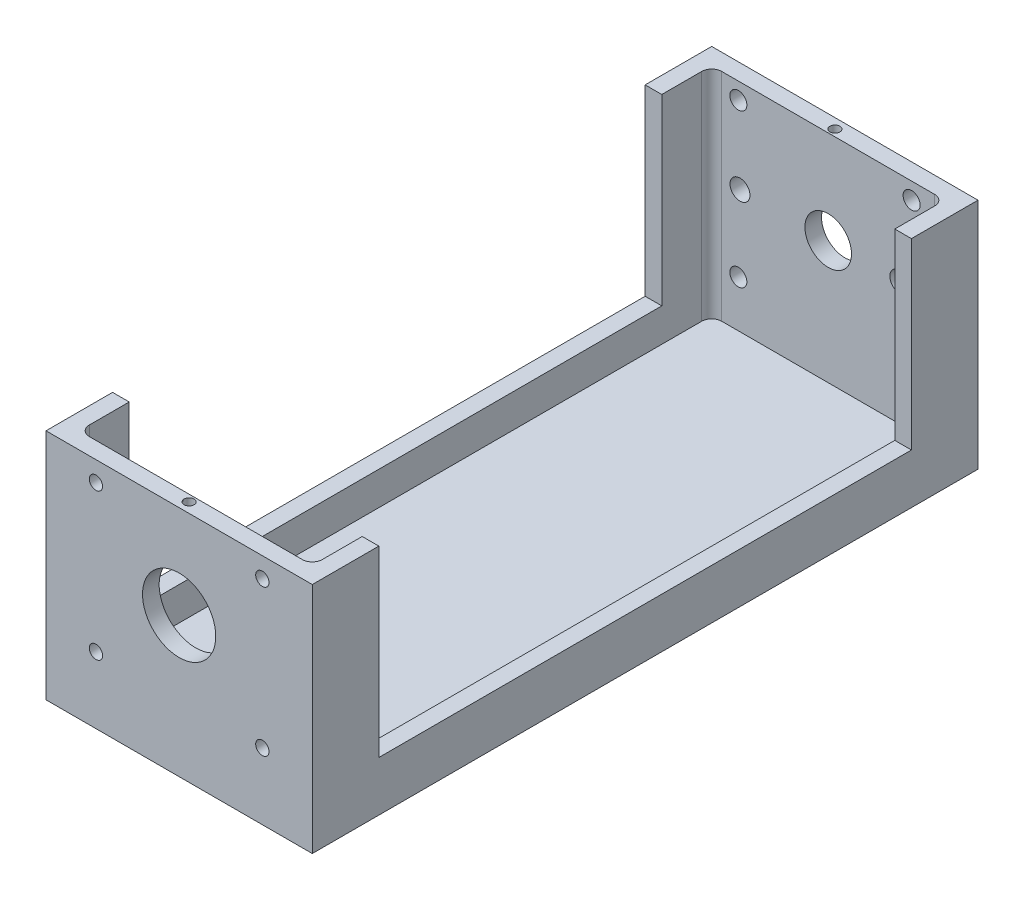
ISO-10303-21;
HEADER;
FILE_DESCRIPTION(('STEP AP214'),'2;1');
FILE_NAME('part.step','',(''),(''),'','','');
FILE_SCHEMA(('AUTOMOTIVE_DESIGN { 1 0 10303 214 1 1 1 1 }'));
ENDSEC;
DATA;
#1=APPLICATION_CONTEXT('core data for automotive mechanical design processes');
#2=APPLICATION_PROTOCOL_DEFINITION('international standard','automotive_design',2000,#1);
#3=PRODUCT_CONTEXT('',#1,'mechanical');
#4=PRODUCT('Part','Part','',(#3));
#5=PRODUCT_RELATED_PRODUCT_CATEGORY('part','',(#4));
#6=PRODUCT_DEFINITION_FORMATION('','',#4);
#7=PRODUCT_DEFINITION_CONTEXT('part definition',#1,'design');
#8=PRODUCT_DEFINITION('design','',#6,#7);
#9=PRODUCT_DEFINITION_SHAPE('','',#8);
#10=(LENGTH_UNIT() NAMED_UNIT(*) SI_UNIT(.MILLI.,.METRE.));
#11=(NAMED_UNIT(*) PLANE_ANGLE_UNIT() SI_UNIT($,.RADIAN.));
#12=(NAMED_UNIT(*) SI_UNIT($,.STERADIAN.) SOLID_ANGLE_UNIT());
#13=UNCERTAINTY_MEASURE_WITH_UNIT(LENGTH_MEASURE(1.E-05),#10,'distance_accuracy_value','');
#14=(GEOMETRIC_REPRESENTATION_CONTEXT(3) GLOBAL_UNCERTAINTY_ASSIGNED_CONTEXT((#13)) GLOBAL_UNIT_ASSIGNED_CONTEXT((#10,
#11,#12)) REPRESENTATION_CONTEXT('',''));
#15=CARTESIAN_POINT('',(0.,0.,0.));
#16=DIRECTION('',(0.,0.,1.));
#17=DIRECTION('',(1.,0.,0.));
#18=AXIS2_PLACEMENT_3D('',#15,#16,#17);
#19=CARTESIAN_POINT('',(-40.,35.,-200.));
#20=DIRECTION('',(0.,1.,0.));
#21=DIRECTION('',(0.,0.,1.));
#22=AXIS2_PLACEMENT_3D('',#19,#20,#21);
#23=PLANE('',#22);
#24=DIRECTION('',(1.,0.,0.));
#25=VECTOR('',#24,1.);
#26=CARTESIAN_POINT('',(-40.,35.,-180.));
#27=LINE('',#26,#25);
#28=CARTESIAN_POINT('',(35.,35.,-180.));
#29=VERTEX_POINT('',#28);
#30=CARTESIAN_POINT('',(40.,35.,-180.));
#31=VERTEX_POINT('',#30);
#32=EDGE_CURVE('E185',#29,#31,#27,.T.);
#33=ORIENTED_EDGE('',*,*,#32,.T.);
#34=DIRECTION('',(0.,0.,1.));
#35=VECTOR('',#34,1.);
#36=CARTESIAN_POINT('',(40.,35.,-200.));
#37=LINE('',#36,#35);
#38=CARTESIAN_POINT('',(40.,35.,-200.));
#39=VERTEX_POINT('',#38);
#40=EDGE_CURVE('E208',#39,#31,#37,.T.);
#41=ORIENTED_EDGE('',*,*,#40,.F.);
#42=DIRECTION('',(-1.,0.,0.));
#43=VECTOR('',#42,1.);
#44=CARTESIAN_POINT('',(-40.,35.,-200.));
#45=LINE('',#44,#43);
#46=CARTESIAN_POINT('',(-40.,35.,-200.));
#47=VERTEX_POINT('',#46);
#48=EDGE_CURVE('E202',#39,#47,#45,.T.);
#49=ORIENTED_EDGE('',*,*,#48,.T.);
#50=DIRECTION('',(0.,0.,1.));
#51=VECTOR('',#50,1.);
#52=CARTESIAN_POINT('',(-40.,35.,-200.));
#53=LINE('',#52,#51);
#54=CARTESIAN_POINT('',(-40.,35.,-180.));
#55=VERTEX_POINT('',#54);
#56=EDGE_CURVE('E190',#47,#55,#53,.T.);
#57=ORIENTED_EDGE('',*,*,#56,.T.);
#58=CARTESIAN_POINT('',(-35.,35.,-180.));
#59=VERTEX_POINT('',#58);
#60=EDGE_CURVE('E174',#55,#59,#27,.T.);
#61=ORIENTED_EDGE('',*,*,#60,.T.);
#62=DIRECTION('',(0.,0.,1.));
#63=VECTOR('',#62,1.);
#64=CARTESIAN_POINT('',(-35.,35.,0.));
#65=LINE('',#64,#63);
#66=CARTESIAN_POINT('',(-35.,35.,-192.));
#67=VERTEX_POINT('',#66);
#68=EDGE_CURVE('E353',#67,#59,#65,.T.);
#69=ORIENTED_EDGE('',*,*,#68,.F.);
#70=CARTESIAN_POINT('',(-32.,35.,-192.));
#71=DIRECTION('',(0.,1.,0.));
#72=DIRECTION('',(0.,0.,1.));
#73=AXIS2_PLACEMENT_3D('',#70,#71,#72);
#74=CIRCLE('',#73,3.);
#75=CARTESIAN_POINT('',(-32.,35.,-195.));
#76=VERTEX_POINT('',#75);
#77=EDGE_CURVE('E217',#67,#76,#74,.F.);
#78=ORIENTED_EDGE('',*,*,#77,.T.);
#79=DIRECTION('',(-1.,0.,0.));
#80=VECTOR('',#79,1.);
#81=CARTESIAN_POINT('',(0.,35.,-195.));
#82=LINE('',#81,#80);
#83=CARTESIAN_POINT('',(32.,35.,-195.));
#84=VERTEX_POINT('',#83);
#85=EDGE_CURVE('E328',#84,#76,#82,.T.);
#86=ORIENTED_EDGE('',*,*,#85,.F.);
#87=CARTESIAN_POINT('',(32.,35.,-192.));
#88=DIRECTION('',(0.,1.,0.));
#89=DIRECTION('',(0.,0.,1.));
#90=AXIS2_PLACEMENT_3D('',#87,#88,#89);
#91=CIRCLE('',#90,3.);
#92=CARTESIAN_POINT('',(35.,35.,-192.));
#93=VERTEX_POINT('',#92);
#94=EDGE_CURVE('E368',#93,#84,#91,.T.);
#95=ORIENTED_EDGE('',*,*,#94,.F.);
#96=DIRECTION('',(0.,0.,-1.));
#97=VECTOR('',#96,1.);
#98=CARTESIAN_POINT('',(35.,35.,0.));
#99=LINE('',#98,#97);
#100=EDGE_CURVE('E364',#29,#93,#99,.T.);
#101=ORIENTED_EDGE('',*,*,#100,.F.);
#102=EDGE_LOOP('',(#33,#41,#49,#57,#61,#69,#78,#86,#95,#101));
#103=FACE_BOUND('',#102,.T.);
#104=CARTESIAN_POINT('',(0.,35.,-197.));
#105=DIRECTION('',(0.,1.,0.));
#106=DIRECTION('',(0.,0.,1.));
#107=AXIS2_PLACEMENT_3D('',#104,#105,#106);
#108=CIRCLE('',#107,1.5);
#109=CARTESIAN_POINT('',(0.,35.,-195.5));
#110=VERTEX_POINT('',#109);
#111=EDGE_CURVE('E315',#110,#110,#108,.T.);
#112=ORIENTED_EDGE('',*,*,#111,.F.);
#113=EDGE_LOOP('',(#112));
#114=FACE_BOUND('',#113,.T.);
#115=ADVANCED_FACE('F35',(#103,#114),#23,.T.);
#116=DIRECTION('',(1.,0.,0.));
#117=VECTOR('',#116,1.);
#118=CARTESIAN_POINT('',(-40.,35.,-20.));
#119=LINE('',#118,#117);
#120=CARTESIAN_POINT('',(-40.,35.,-20.));
#121=VERTEX_POINT('',#120);
#122=CARTESIAN_POINT('',(-35.,35.,-20.));
#123=VERTEX_POINT('',#122);
#124=EDGE_CURVE('E60',#121,#123,#119,.T.);
#125=ORIENTED_EDGE('',*,*,#124,.F.);
#126=CARTESIAN_POINT('',(-40.,35.,0.));
#127=VERTEX_POINT('',#126);
#128=EDGE_CURVE('E204',#121,#127,#53,.T.);
#129=ORIENTED_EDGE('',*,*,#128,.T.);
#130=DIRECTION('',(-1.,0.,0.));
#131=VECTOR('',#130,1.);
#132=CARTESIAN_POINT('',(-40.,35.,0.));
#133=LINE('',#132,#131);
#134=CARTESIAN_POINT('',(40.,35.,0.));
#135=VERTEX_POINT('',#134);
#136=EDGE_CURVE('E404',#135,#127,#133,.T.);
#137=ORIENTED_EDGE('',*,*,#136,.F.);
#138=CARTESIAN_POINT('',(40.,35.,-20.));
#139=VERTEX_POINT('',#138);
#140=EDGE_CURVE('E213',#139,#135,#37,.T.);
#141=ORIENTED_EDGE('',*,*,#140,.F.);
#142=CARTESIAN_POINT('',(35.,35.,-20.));
#143=VERTEX_POINT('',#142);
#144=EDGE_CURVE('E184',#143,#139,#119,.T.);
#145=ORIENTED_EDGE('',*,*,#144,.F.);
#146=CARTESIAN_POINT('',(35.,35.,-8.));
#147=VERTEX_POINT('',#146);
#148=EDGE_CURVE('E365',#147,#143,#99,.T.);
#149=ORIENTED_EDGE('',*,*,#148,.F.);
#150=CARTESIAN_POINT('',(32.,35.,-8.));
#151=DIRECTION('',(0.,1.,0.));
#152=DIRECTION('',(0.,0.,1.));
#153=AXIS2_PLACEMENT_3D('',#150,#151,#152);
#154=CIRCLE('',#153,3.);
#155=CARTESIAN_POINT('',(32.,35.,-5.));
#156=VERTEX_POINT('',#155);
#157=EDGE_CURVE('E361',#156,#147,#154,.T.);
#158=ORIENTED_EDGE('',*,*,#157,.F.);
#159=DIRECTION('',(1.,0.,0.));
#160=VECTOR('',#159,1.);
#161=CARTESIAN_POINT('',(0.,35.,-5.));
#162=LINE('',#161,#160);
#163=CARTESIAN_POINT('',(-32.,35.,-5.));
#164=VERTEX_POINT('',#163);
#165=EDGE_CURVE('E358',#164,#156,#162,.T.);
#166=ORIENTED_EDGE('',*,*,#165,.F.);
#167=CARTESIAN_POINT('',(-32.,35.,-8.));
#168=DIRECTION('',(0.,1.,0.));
#169=DIRECTION('',(0.,0.,1.));
#170=AXIS2_PLACEMENT_3D('',#167,#168,#169);
#171=CIRCLE('',#170,3.);
#172=CARTESIAN_POINT('',(-35.,35.,-8.));
#173=VERTEX_POINT('',#172);
#174=EDGE_CURVE('E355',#173,#164,#171,.T.);
#175=ORIENTED_EDGE('',*,*,#174,.F.);
#176=EDGE_CURVE('E352',#123,#173,#65,.T.);
#177=ORIENTED_EDGE('',*,*,#176,.F.);
#178=EDGE_LOOP('',(#125,#129,#137,#141,#145,#149,#158,#166,#175,#177));
#179=FACE_BOUND('',#178,.T.);
#180=CARTESIAN_POINT('',(0.,35.,-3.));
#181=DIRECTION('',(0.,1.,0.));
#182=DIRECTION('',(0.,0.,1.));
#183=AXIS2_PLACEMENT_3D('',#180,#181,#182);
#184=CIRCLE('',#183,1.5);
#185=CARTESIAN_POINT('',(0.,35.,-1.5));
#186=VERTEX_POINT('',#185);
#187=EDGE_CURVE('E311',#186,#186,#184,.T.);
#188=ORIENTED_EDGE('',*,*,#187,.F.);
#189=EDGE_LOOP('',(#188));
#190=FACE_BOUND('',#189,.T.);
#191=ADVANCED_FACE('F440',(#179,#190),#23,.T.);
#192=CARTESIAN_POINT('',(40.,-35.,-200.));
#193=DIRECTION('',(1.,0.,0.));
#194=DIRECTION('',(0.,0.,-1.));
#195=AXIS2_PLACEMENT_3D('',#192,#193,#194);
#196=PLANE('',#195);
#197=DIRECTION('',(0.,1.,0.));
#198=VECTOR('',#197,1.);
#199=CARTESIAN_POINT('',(40.,35.,-180.));
#200=LINE('',#199,#198);
#201=CARTESIAN_POINT('',(40.,-20.,-180.));
#202=VERTEX_POINT('',#201);
#203=EDGE_CURVE('E226',#202,#31,#200,.T.);
#204=ORIENTED_EDGE('',*,*,#203,.F.);
#205=DIRECTION('',(0.,0.,-1.));
#206=VECTOR('',#205,1.);
#207=CARTESIAN_POINT('',(40.,-20.,-20.));
#208=LINE('',#207,#206);
#209=CARTESIAN_POINT('',(40.,-20.,-20.));
#210=VERTEX_POINT('',#209);
#211=EDGE_CURVE('E196',#210,#202,#208,.T.);
#212=ORIENTED_EDGE('',*,*,#211,.F.);
#213=DIRECTION('',(0.,-1.,0.));
#214=VECTOR('',#213,1.);
#215=CARTESIAN_POINT('',(40.,35.,-20.));
#216=LINE('',#215,#214);
#217=EDGE_CURVE('E291',#139,#210,#216,.T.);
#218=ORIENTED_EDGE('',*,*,#217,.F.);
#219=ORIENTED_EDGE('',*,*,#140,.T.);
#220=DIRECTION('',(0.,1.,0.));
#221=VECTOR('',#220,1.);
#222=CARTESIAN_POINT('',(40.,-35.,0.));
#223=LINE('',#222,#221);
#224=CARTESIAN_POINT('',(40.,-35.,0.));
#225=VERTEX_POINT('',#224);
#226=EDGE_CURVE('E375',#225,#135,#223,.T.);
#227=ORIENTED_EDGE('',*,*,#226,.F.);
#228=DIRECTION('',(0.,0.,1.));
#229=VECTOR('',#228,1.);
#230=CARTESIAN_POINT('',(40.,-35.,-200.));
#231=LINE('',#230,#229);
#232=CARTESIAN_POINT('',(40.,-35.,-200.));
#233=VERTEX_POINT('',#232);
#234=EDGE_CURVE('E206',#233,#225,#231,.T.);
#235=ORIENTED_EDGE('',*,*,#234,.F.);
#236=DIRECTION('',(0.,1.,0.));
#237=VECTOR('',#236,1.);
#238=CARTESIAN_POINT('',(40.,-35.,-200.));
#239=LINE('',#238,#237);
#240=EDGE_CURVE('E392',#233,#39,#239,.T.);
#241=ORIENTED_EDGE('',*,*,#240,.T.);
#242=ORIENTED_EDGE('',*,*,#40,.T.);
#243=EDGE_LOOP('',(#204,#212,#218,#219,#227,#235,#241,#242));
#244=FACE_BOUND('',#243,.T.);
#245=ADVANCED_FACE('F37',(#244),#196,.T.);
#246=CARTESIAN_POINT('',(-40.,-35.,-200.));
#247=DIRECTION('',(0.,-1.,0.));
#248=DIRECTION('',(0.,0.,-1.));
#249=AXIS2_PLACEMENT_3D('',#246,#247,#248);
#250=PLANE('',#249);
#251=DIRECTION('',(1.,0.,0.));
#252=VECTOR('',#251,1.);
#253=CARTESIAN_POINT('',(-40.,-35.,0.));
#254=LINE('',#253,#252);
#255=CARTESIAN_POINT('',(-40.,-35.,0.));
#256=VERTEX_POINT('',#255);
#257=EDGE_CURVE('E395',#256,#225,#254,.T.);
#258=ORIENTED_EDGE('',*,*,#257,.F.);
#259=DIRECTION('',(0.,0.,1.));
#260=VECTOR('',#259,1.);
#261=CARTESIAN_POINT('',(-40.,-35.,-200.));
#262=LINE('',#261,#260);
#263=CARTESIAN_POINT('',(-40.,-35.,-200.));
#264=VERTEX_POINT('',#263);
#265=EDGE_CURVE('E203',#264,#256,#262,.T.);
#266=ORIENTED_EDGE('',*,*,#265,.F.);
#267=DIRECTION('',(1.,0.,0.));
#268=VECTOR('',#267,1.);
#269=CARTESIAN_POINT('',(-40.,-35.,-200.));
#270=LINE('',#269,#268);
#271=EDGE_CURVE('E399',#264,#233,#270,.T.);
#272=ORIENTED_EDGE('',*,*,#271,.T.);
#273=ORIENTED_EDGE('',*,*,#234,.T.);
#274=EDGE_LOOP('',(#258,#266,#272,#273));
#275=FACE_BOUND('',#274,.T.);
#276=ADVANCED_FACE('F414',(#275),#250,.T.);
#277=CARTESIAN_POINT('',(-40.,-35.,-200.));
#278=DIRECTION('',(-1.,0.,0.));
#279=DIRECTION('',(0.,0.,1.));
#280=AXIS2_PLACEMENT_3D('',#277,#278,#279);
#281=PLANE('',#280);
#282=DIRECTION('',(0.,1.,0.));
#283=VECTOR('',#282,1.);
#284=CARTESIAN_POINT('',(-40.,35.,-180.));
#285=LINE('',#284,#283);
#286=CARTESIAN_POINT('',(-40.,-20.,-180.));
#287=VERTEX_POINT('',#286);
#288=EDGE_CURVE('E178',#287,#55,#285,.T.);
#289=ORIENTED_EDGE('',*,*,#288,.T.);
#290=ORIENTED_EDGE('',*,*,#56,.F.);
#291=DIRECTION('',(0.,-1.,0.));
#292=VECTOR('',#291,1.);
#293=CARTESIAN_POINT('',(-40.,-35.,-200.));
#294=LINE('',#293,#292);
#295=EDGE_CURVE('E397',#47,#264,#294,.T.);
#296=ORIENTED_EDGE('',*,*,#295,.T.);
#297=ORIENTED_EDGE('',*,*,#265,.T.);
#298=DIRECTION('',(0.,-1.,0.));
#299=VECTOR('',#298,1.);
#300=CARTESIAN_POINT('',(-40.,-35.,0.));
#301=LINE('',#300,#299);
#302=EDGE_CURVE('E407',#127,#256,#301,.T.);
#303=ORIENTED_EDGE('',*,*,#302,.F.);
#304=ORIENTED_EDGE('',*,*,#128,.F.);
#305=DIRECTION('',(0.,-1.,0.));
#306=VECTOR('',#305,1.);
#307=CARTESIAN_POINT('',(-40.,35.,-20.));
#308=LINE('',#307,#306);
#309=CARTESIAN_POINT('',(-40.,-20.,-20.));
#310=VERTEX_POINT('',#309);
#311=EDGE_CURVE('E195',#121,#310,#308,.T.);
#312=ORIENTED_EDGE('',*,*,#311,.T.);
#313=DIRECTION('',(0.,0.,-1.));
#314=VECTOR('',#313,1.);
#315=CARTESIAN_POINT('',(-40.,-20.,-20.));
#316=LINE('',#315,#314);
#317=EDGE_CURVE('E194',#310,#287,#316,.T.);
#318=ORIENTED_EDGE('',*,*,#317,.T.);
#319=EDGE_LOOP('',(#289,#290,#296,#297,#303,#304,#312,#318));
#320=FACE_BOUND('',#319,.T.);
#321=ADVANCED_FACE('F188',(#320),#281,.T.);
#322=CARTESIAN_POINT('',(0.,0.,-200.));
#323=DIRECTION('',(0.,0.,-1.));
#324=DIRECTION('',(-1.,0.,0.));
#325=AXIS2_PLACEMENT_3D('',#322,#323,#324);
#326=PLANE('',#325);
#327=CARTESIAN_POINT('',(25.052626778137,29.999999999999,-200.));
#328=DIRECTION('',(0.,0.,-1.));
#329=DIRECTION('',(-1.,0.,0.));
#330=AXIS2_PLACEMENT_3D('',#327,#328,#329);
#331=CIRCLE('',#330,2.55508771063859);
#332=CARTESIAN_POINT('',(22.4975390674984,29.999999999999,-200.));
#333=VERTEX_POINT('',#332);
#334=EDGE_CURVE('E244',#333,#333,#331,.T.);
#335=ORIENTED_EDGE('',*,*,#334,.F.);
#336=EDGE_LOOP('',(#335));
#337=FACE_BOUND('',#336,.T.);
#338=CARTESIAN_POINT('',(-26.9999999999993,29.999999999999,-200.));
#339=DIRECTION('',(0.,0.,-1.));
#340=DIRECTION('',(-1.,0.,0.));
#341=AXIS2_PLACEMENT_3D('',#338,#339,#340);
#342=CIRCLE('',#341,2.55508771063859);
#343=CARTESIAN_POINT('',(-29.5550877106378,29.999999999999,-200.));
#344=VERTEX_POINT('',#343);
#345=EDGE_CURVE('E275',#344,#344,#342,.T.);
#346=ORIENTED_EDGE('',*,*,#345,.F.);
#347=EDGE_LOOP('',(#346));
#348=FACE_BOUND('',#347,.T.);
#349=CARTESIAN_POINT('',(-26.9999999999993,-16.000000000001,-200.));
#350=DIRECTION('',(0.,0.,-1.));
#351=DIRECTION('',(-1.,0.,0.));
#352=AXIS2_PLACEMENT_3D('',#349,#350,#351);
#353=CIRCLE('',#352,2.55508771063859);
#354=CARTESIAN_POINT('',(-29.5550877106378,-16.000000000001,-200.));
#355=VERTEX_POINT('',#354);
#356=EDGE_CURVE('E253',#355,#355,#353,.T.);
#357=ORIENTED_EDGE('',*,*,#356,.F.);
#358=EDGE_LOOP('',(#357));
#359=FACE_BOUND('',#358,.T.);
#360=CARTESIAN_POINT('',(25.052626778137,-16.000000000001,-200.));
#361=DIRECTION('',(0.,0.,-1.));
#362=DIRECTION('',(-1.,0.,0.));
#363=AXIS2_PLACEMENT_3D('',#360,#361,#362);
#364=CIRCLE('',#363,2.55508771063859);
#365=CARTESIAN_POINT('',(22.4975390674984,-16.000000000001,-200.));
#366=VERTEX_POINT('',#365);
#367=EDGE_CURVE('E239',#366,#366,#364,.T.);
#368=ORIENTED_EDGE('',*,*,#367,.F.);
#369=EDGE_LOOP('',(#368));
#370=FACE_BOUND('',#369,.T.);
#371=CARTESIAN_POINT('',(-26.4999999999942,6.99999999999978,-200.));
#372=DIRECTION('',(0.,0.,-1.));
#373=DIRECTION('',(-1.,0.,0.));
#374=AXIS2_PLACEMENT_3D('',#371,#372,#373);
#375=CIRCLE('',#374,2.99999999999999);
#376=CARTESIAN_POINT('',(-29.4999999999942,6.99999999999978,-200.));
#377=VERTEX_POINT('',#376);
#378=EDGE_CURVE('E235',#377,#377,#375,.T.);
#379=ORIENTED_EDGE('',*,*,#378,.F.);
#380=EDGE_LOOP('',(#379));
#381=FACE_BOUND('',#380,.T.);
#382=CARTESIAN_POINT('',(21.5000000000058,6.99999999999978,-200.));
#383=DIRECTION('',(0.,0.,-1.));
#384=DIRECTION('',(-1.,0.,0.));
#385=AXIS2_PLACEMENT_3D('',#382,#383,#384);
#386=CIRCLE('',#385,2.99999999999999);
#387=CARTESIAN_POINT('',(18.5000000000058,6.99999999999978,-200.));
#388=VERTEX_POINT('',#387);
#389=EDGE_CURVE('E231',#388,#388,#386,.T.);
#390=ORIENTED_EDGE('',*,*,#389,.F.);
#391=EDGE_LOOP('',(#390));
#392=FACE_BOUND('',#391,.T.);
#393=CARTESIAN_POINT('',(0.,7.00000000000002,-200.));
#394=DIRECTION('',(0.,0.,-1.));
#395=DIRECTION('',(-1.,0.,0.));
#396=AXIS2_PLACEMENT_3D('',#393,#394,#395);
#397=CIRCLE('',#396,7.);
#398=CARTESIAN_POINT('',(-7.,7.00000000000002,-200.));
#399=VERTEX_POINT('',#398);
#400=EDGE_CURVE('E227',#399,#399,#397,.T.);
#401=ORIENTED_EDGE('',*,*,#400,.F.);
#402=EDGE_LOOP('',(#401));
#403=FACE_BOUND('',#402,.T.);
#404=ORIENTED_EDGE('',*,*,#240,.F.);
#405=ORIENTED_EDGE('',*,*,#271,.F.);
#406=ORIENTED_EDGE('',*,*,#295,.F.);
#407=ORIENTED_EDGE('',*,*,#48,.F.);
#408=EDGE_LOOP('',(#404,#405,#406,#407));
#409=FACE_BOUND('',#408,.T.);
#410=ADVANCED_FACE('F427',(#337,#348,#359,#370,#381,#392,#403,#409),#326,.T.);
#411=CARTESIAN_POINT('',(0.,0.,0.));
#412=DIRECTION('',(0.,0.,-1.));
#413=DIRECTION('',(-1.,0.,0.));
#414=AXIS2_PLACEMENT_3D('',#411,#412,#413);
#415=PLANE('',#414);
#416=CARTESIAN_POINT('',(25.0000000000009,29.0000000000007,0.));
#417=DIRECTION('',(0.,0.,1.));
#418=DIRECTION('',(1.,0.,0.));
#419=AXIS2_PLACEMENT_3D('',#416,#417,#418);
#420=CIRCLE('',#419,2.);
#421=CARTESIAN_POINT('',(27.0000000000009,29.0000000000007,0.));
#422=VERTEX_POINT('',#421);
#423=EDGE_CURVE('E258',#422,#422,#420,.T.);
#424=ORIENTED_EDGE('',*,*,#423,.F.);
#425=EDGE_LOOP('',(#424));
#426=FACE_BOUND('',#425,.T.);
#427=CARTESIAN_POINT('',(-24.9999999999991,29.0000000000007,0.));
#428=DIRECTION('',(0.,0.,1.));
#429=DIRECTION('',(1.,0.,0.));
#430=AXIS2_PLACEMENT_3D('',#427,#428,#429);
#431=CIRCLE('',#430,2.);
#432=CARTESIAN_POINT('',(-22.9999999999991,29.0000000000007,0.));
#433=VERTEX_POINT('',#432);
#434=EDGE_CURVE('E815',#433,#433,#431,.T.);
#435=ORIENTED_EDGE('',*,*,#434,.F.);
#436=EDGE_LOOP('',(#435));
#437=FACE_BOUND('',#436,.T.);
#438=CARTESIAN_POINT('',(-24.9999999999991,-14.9999999999993,0.));
#439=DIRECTION('',(0.,0.,1.));
#440=DIRECTION('',(1.,0.,0.));
#441=AXIS2_PLACEMENT_3D('',#438,#439,#440);
#442=CIRCLE('',#441,2.);
#443=CARTESIAN_POINT('',(-22.9999999999991,-14.9999999999993,0.));
#444=VERTEX_POINT('',#443);
#445=EDGE_CURVE('E271',#444,#444,#442,.T.);
#446=ORIENTED_EDGE('',*,*,#445,.F.);
#447=EDGE_LOOP('',(#446));
#448=FACE_BOUND('',#447,.T.);
#449=CARTESIAN_POINT('',(25.0000000000009,-14.9999999999993,0.));
#450=DIRECTION('',(0.,0.,1.));
#451=DIRECTION('',(1.,0.,0.));
#452=AXIS2_PLACEMENT_3D('',#449,#450,#451);
#453=CIRCLE('',#452,2.);
#454=CARTESIAN_POINT('',(27.0000000000009,-14.9999999999993,0.));
#455=VERTEX_POINT('',#454);
#456=EDGE_CURVE('E254',#455,#455,#453,.T.);
#457=ORIENTED_EDGE('',*,*,#456,.F.);
#458=EDGE_LOOP('',(#457));
#459=FACE_BOUND('',#458,.T.);
#460=CARTESIAN_POINT('',(0.,7.00000000000002,0.));
#461=DIRECTION('',(0.,0.,1.));
#462=DIRECTION('',(1.,0.,0.));
#463=AXIS2_PLACEMENT_3D('',#460,#461,#462);
#464=CIRCLE('',#463,11.);
#465=CARTESIAN_POINT('',(11.,7.00000000000002,0.));
#466=VERTEX_POINT('',#465);
#467=EDGE_CURVE('E218',#466,#466,#464,.T.);
#468=ORIENTED_EDGE('',*,*,#467,.F.);
#469=EDGE_LOOP('',(#468));
#470=FACE_BOUND('',#469,.T.);
#471=ORIENTED_EDGE('',*,*,#226,.T.);
#472=ORIENTED_EDGE('',*,*,#136,.T.);
#473=ORIENTED_EDGE('',*,*,#302,.T.);
#474=ORIENTED_EDGE('',*,*,#257,.T.);
#475=EDGE_LOOP('',(#471,#472,#473,#474));
#476=FACE_BOUND('',#475,.T.);
#477=ADVANCED_FACE('F423',(#426,#437,#448,#459,#470,#476),#415,.F.);
#478=CARTESIAN_POINT('',(-32.,-30.,-192.));
#479=DIRECTION('',(0.,1.,0.));
#480=DIRECTION('',(0.,0.,1.));
#481=AXIS2_PLACEMENT_3D('',#478,#479,#480);
#482=CYLINDRICAL_SURFACE('',#481,3.);
#483=ORIENTED_EDGE('',*,*,#77,.F.);
#484=DIRECTION('',(0.,1.,0.));
#485=VECTOR('',#484,1.);
#486=CARTESIAN_POINT('',(-35.,-30.,-192.));
#487=LINE('',#486,#485);
#488=CARTESIAN_POINT('',(-35.,-30.,-192.));
#489=VERTEX_POINT('',#488);
#490=EDGE_CURVE('E349',#489,#67,#487,.T.);
#491=ORIENTED_EDGE('',*,*,#490,.F.);
#492=CARTESIAN_POINT('',(-32.,-30.,-192.));
#493=DIRECTION('',(0.,1.,0.));
#494=DIRECTION('',(0.,0.,1.));
#495=AXIS2_PLACEMENT_3D('',#492,#493,#494);
#496=CIRCLE('',#495,3.);
#497=CARTESIAN_POINT('',(-32.,-30.,-195.));
#498=VERTEX_POINT('',#497);
#499=EDGE_CURVE('E325',#489,#498,#496,.F.);
#500=ORIENTED_EDGE('',*,*,#499,.T.);
#501=DIRECTION('',(0.,1.,0.));
#502=VECTOR('',#501,1.);
#503=CARTESIAN_POINT('',(-32.,-30.,-195.));
#504=LINE('',#503,#502);
#505=EDGE_CURVE('E373',#498,#76,#504,.T.);
#506=ORIENTED_EDGE('',*,*,#505,.T.);
#507=EDGE_LOOP('',(#483,#491,#500,#506));
#508=FACE_BOUND('',#507,.T.);
#509=ADVANCED_FACE('F458',(#508),#482,.F.);
#510=CARTESIAN_POINT('',(0.,-30.,-195.));
#511=DIRECTION('',(0.,0.,-1.));
#512=DIRECTION('',(-1.,0.,0.));
#513=AXIS2_PLACEMENT_3D('',#510,#511,#512);
#514=PLANE('',#513);
#515=CARTESIAN_POINT('',(25.052626778137,29.999999999999,-195.));
#516=DIRECTION('',(0.,0.,-1.));
#517=DIRECTION('',(-1.,0.,0.));
#518=AXIS2_PLACEMENT_3D('',#515,#516,#517);
#519=CIRCLE('',#518,2.55508771063859);
#520=CARTESIAN_POINT('',(22.4975390674984,29.999999999999,-195.));
#521=VERTEX_POINT('',#520);
#522=EDGE_CURVE('E247',#521,#521,#519,.T.);
#523=ORIENTED_EDGE('',*,*,#522,.T.);
#524=EDGE_LOOP('',(#523));
#525=FACE_BOUND('',#524,.T.);
#526=CARTESIAN_POINT('',(-26.9999999999993,29.999999999999,-195.));
#527=DIRECTION('',(0.,0.,-1.));
#528=DIRECTION('',(-1.,0.,0.));
#529=AXIS2_PLACEMENT_3D('',#526,#527,#528);
#530=CIRCLE('',#529,2.55508771063859);
#531=CARTESIAN_POINT('',(-29.5550877106378,29.999999999999,-195.));
#532=VERTEX_POINT('',#531);
#533=EDGE_CURVE('E243',#532,#532,#530,.T.);
#534=ORIENTED_EDGE('',*,*,#533,.T.);
#535=EDGE_LOOP('',(#534));
#536=FACE_BOUND('',#535,.T.);
#537=CARTESIAN_POINT('',(-26.9999999999993,-16.000000000001,-195.));
#538=DIRECTION('',(0.,0.,-1.));
#539=DIRECTION('',(-1.,0.,0.));
#540=AXIS2_PLACEMENT_3D('',#537,#538,#539);
#541=CIRCLE('',#540,2.55508771063859);
#542=CARTESIAN_POINT('',(-29.5550877106378,-16.000000000001,-195.));
#543=VERTEX_POINT('',#542);
#544=EDGE_CURVE('E240',#543,#543,#541,.T.);
#545=ORIENTED_EDGE('',*,*,#544,.T.);
#546=EDGE_LOOP('',(#545));
#547=FACE_BOUND('',#546,.T.);
#548=CARTESIAN_POINT('',(25.052626778137,-16.000000000001,-195.));
#549=DIRECTION('',(0.,0.,-1.));
#550=DIRECTION('',(-1.,0.,0.));
#551=AXIS2_PLACEMENT_3D('',#548,#549,#550);
#552=CIRCLE('',#551,2.55508771063859);
#553=CARTESIAN_POINT('',(22.4975390674984,-16.000000000001,-195.));
#554=VERTEX_POINT('',#553);
#555=EDGE_CURVE('E236',#554,#554,#552,.T.);
#556=ORIENTED_EDGE('',*,*,#555,.T.);
#557=EDGE_LOOP('',(#556));
#558=FACE_BOUND('',#557,.T.);
#559=CARTESIAN_POINT('',(-26.4999999999942,6.99999999999978,-195.));
#560=DIRECTION('',(0.,0.,-1.));
#561=DIRECTION('',(-1.,0.,0.));
#562=AXIS2_PLACEMENT_3D('',#559,#560,#561);
#563=CIRCLE('',#562,2.99999999999999);
#564=CARTESIAN_POINT('',(-29.4999999999942,6.99999999999978,-195.));
#565=VERTEX_POINT('',#564);
#566=EDGE_CURVE('E232',#565,#565,#563,.T.);
#567=ORIENTED_EDGE('',*,*,#566,.T.);
#568=EDGE_LOOP('',(#567));
#569=FACE_BOUND('',#568,.T.);
#570=CARTESIAN_POINT('',(21.5000000000058,6.99999999999978,-195.));
#571=DIRECTION('',(0.,0.,-1.));
#572=DIRECTION('',(-1.,0.,0.));
#573=AXIS2_PLACEMENT_3D('',#570,#571,#572);
#574=CIRCLE('',#573,2.99999999999999);
#575=CARTESIAN_POINT('',(18.5000000000058,6.99999999999978,-195.));
#576=VERTEX_POINT('',#575);
#577=EDGE_CURVE('E228',#576,#576,#574,.T.);
#578=ORIENTED_EDGE('',*,*,#577,.T.);
#579=EDGE_LOOP('',(#578));
#580=FACE_BOUND('',#579,.T.);
#581=CARTESIAN_POINT('',(0.,7.00000000000002,-195.));
#582=DIRECTION('',(0.,0.,-1.));
#583=DIRECTION('',(-1.,0.,0.));
#584=AXIS2_PLACEMENT_3D('',#581,#582,#583);
#585=CIRCLE('',#584,7.);
#586=CARTESIAN_POINT('',(-7.,7.00000000000002,-195.));
#587=VERTEX_POINT('',#586);
#588=EDGE_CURVE('E223',#587,#587,#585,.T.);
#589=ORIENTED_EDGE('',*,*,#588,.T.);
#590=EDGE_LOOP('',(#589));
#591=FACE_BOUND('',#590,.T.);
#592=ORIENTED_EDGE('',*,*,#85,.T.);
#593=ORIENTED_EDGE('',*,*,#505,.F.);
#594=DIRECTION('',(-1.,0.,0.));
#595=VECTOR('',#594,1.);
#596=CARTESIAN_POINT('',(0.,-30.,-195.));
#597=LINE('',#596,#595);
#598=CARTESIAN_POINT('',(32.,-30.,-195.));
#599=VERTEX_POINT('',#598);
#600=EDGE_CURVE('E346',#599,#498,#597,.T.);
#601=ORIENTED_EDGE('',*,*,#600,.F.);
#602=DIRECTION('',(0.,1.,0.));
#603=VECTOR('',#602,1.);
#604=CARTESIAN_POINT('',(32.,-30.,-195.));
#605=LINE('',#604,#603);
#606=EDGE_CURVE('E376',#599,#84,#605,.T.);
#607=ORIENTED_EDGE('',*,*,#606,.T.);
#608=EDGE_LOOP('',(#592,#593,#601,#607));
#609=FACE_BOUND('',#608,.T.);
#610=ADVANCED_FACE('F462',(#525,#536,#547,#558,#569,#580,#591,#609),#514,.F.);
#611=CARTESIAN_POINT('',(32.,-30.,-192.));
#612=DIRECTION('',(0.,1.,0.));
#613=DIRECTION('',(0.,0.,1.));
#614=AXIS2_PLACEMENT_3D('',#611,#612,#613);
#615=CYLINDRICAL_SURFACE('',#614,3.);
#616=ORIENTED_EDGE('',*,*,#94,.T.);
#617=ORIENTED_EDGE('',*,*,#606,.F.);
#618=CARTESIAN_POINT('',(32.,-30.,-192.));
#619=DIRECTION('',(0.,1.,0.));
#620=DIRECTION('',(0.,0.,1.));
#621=AXIS2_PLACEMENT_3D('',#618,#619,#620);
#622=CIRCLE('',#621,3.);
#623=CARTESIAN_POINT('',(35.,-30.,-192.));
#624=VERTEX_POINT('',#623);
#625=EDGE_CURVE('E343',#624,#599,#622,.T.);
#626=ORIENTED_EDGE('',*,*,#625,.F.);
#627=DIRECTION('',(0.,1.,0.));
#628=VECTOR('',#627,1.);
#629=CARTESIAN_POINT('',(35.,-30.,-192.));
#630=LINE('',#629,#628);
#631=EDGE_CURVE('E378',#624,#93,#630,.T.);
#632=ORIENTED_EDGE('',*,*,#631,.T.);
#633=EDGE_LOOP('',(#616,#617,#626,#632));
#634=FACE_BOUND('',#633,.T.);
#635=ADVANCED_FACE('F465',(#634),#615,.F.);
#636=CARTESIAN_POINT('',(35.,-30.,0.));
#637=DIRECTION('',(1.,0.,0.));
#638=DIRECTION('',(0.,0.,-1.));
#639=AXIS2_PLACEMENT_3D('',#636,#637,#638);
#640=PLANE('',#639);
#641=DIRECTION('',(0.,0.,-1.));
#642=VECTOR('',#641,1.);
#643=CARTESIAN_POINT('',(35.,-20.,0.));
#644=LINE('',#643,#642);
#645=CARTESIAN_POINT('',(35.,-20.,-20.));
#646=VERTEX_POINT('',#645);
#647=CARTESIAN_POINT('',(35.,-20.,-180.));
#648=VERTEX_POINT('',#647);
#649=EDGE_CURVE('E305',#646,#648,#644,.T.);
#650=ORIENTED_EDGE('',*,*,#649,.T.);
#651=DIRECTION('',(0.,1.,0.));
#652=VECTOR('',#651,1.);
#653=CARTESIAN_POINT('',(35.,-30.,-180.));
#654=LINE('',#653,#652);
#655=EDGE_CURVE('E308',#648,#29,#654,.T.);
#656=ORIENTED_EDGE('',*,*,#655,.T.);
#657=ORIENTED_EDGE('',*,*,#100,.T.);
#658=ORIENTED_EDGE('',*,*,#631,.F.);
#659=DIRECTION('',(0.,0.,-1.));
#660=VECTOR('',#659,1.);
#661=CARTESIAN_POINT('',(35.,-30.,0.));
#662=LINE('',#661,#660);
#663=CARTESIAN_POINT('',(35.,-30.,-8.));
#664=VERTEX_POINT('',#663);
#665=EDGE_CURVE('E340',#664,#624,#662,.T.);
#666=ORIENTED_EDGE('',*,*,#665,.F.);
#667=DIRECTION('',(0.,1.,0.));
#668=VECTOR('',#667,1.);
#669=CARTESIAN_POINT('',(35.,-30.,-8.));
#670=LINE('',#669,#668);
#671=EDGE_CURVE('E381',#664,#147,#670,.T.);
#672=ORIENTED_EDGE('',*,*,#671,.T.);
#673=ORIENTED_EDGE('',*,*,#148,.T.);
#674=DIRECTION('',(0.,-1.,0.));
#675=VECTOR('',#674,1.);
#676=CARTESIAN_POINT('',(35.,-30.,-20.));
#677=LINE('',#676,#675);
#678=EDGE_CURVE('E297',#143,#646,#677,.T.);
#679=ORIENTED_EDGE('',*,*,#678,.T.);
#680=EDGE_LOOP('',(#650,#656,#657,#658,#666,#672,#673,#679));
#681=FACE_BOUND('',#680,.T.);
#682=ADVANCED_FACE('F435',(#681),#640,.F.);
#683=CARTESIAN_POINT('',(32.,-30.,-8.));
#684=DIRECTION('',(0.,1.,0.));
#685=DIRECTION('',(0.,0.,1.));
#686=AXIS2_PLACEMENT_3D('',#683,#684,#685);
#687=CYLINDRICAL_SURFACE('',#686,3.);
#688=ORIENTED_EDGE('',*,*,#157,.T.);
#689=ORIENTED_EDGE('',*,*,#671,.F.);
#690=CARTESIAN_POINT('',(32.,-30.,-8.));
#691=DIRECTION('',(0.,1.,0.));
#692=DIRECTION('',(0.,0.,1.));
#693=AXIS2_PLACEMENT_3D('',#690,#691,#692);
#694=CIRCLE('',#693,3.);
#695=CARTESIAN_POINT('',(32.,-30.,-5.));
#696=VERTEX_POINT('',#695);
#697=EDGE_CURVE('E337',#696,#664,#694,.T.);
#698=ORIENTED_EDGE('',*,*,#697,.F.);
#699=DIRECTION('',(0.,1.,0.));
#700=VECTOR('',#699,1.);
#701=CARTESIAN_POINT('',(32.,-30.,-5.));
#702=LINE('',#701,#700);
#703=EDGE_CURVE('E383',#696,#156,#702,.T.);
#704=ORIENTED_EDGE('',*,*,#703,.T.);
#705=EDGE_LOOP('',(#688,#689,#698,#704));
#706=FACE_BOUND('',#705,.T.);
#707=ADVANCED_FACE('F469',(#706),#687,.F.);
#708=CARTESIAN_POINT('',(0.,-30.,-5.));
#709=DIRECTION('',(0.,0.,1.));
#710=DIRECTION('',(1.,0.,0.));
#711=AXIS2_PLACEMENT_3D('',#708,#709,#710);
#712=PLANE('',#711);
#713=CARTESIAN_POINT('',(25.0000000000009,29.0000000000007,-5.));
#714=DIRECTION('',(0.,0.,1.));
#715=DIRECTION('',(1.,0.,0.));
#716=AXIS2_PLACEMENT_3D('',#713,#714,#715);
#717=CIRCLE('',#716,2.);
#718=CARTESIAN_POINT('',(27.0000000000009,29.0000000000007,-5.));
#719=VERTEX_POINT('',#718);
#720=EDGE_CURVE('E39',#719,#719,#717,.T.);
#721=ORIENTED_EDGE('',*,*,#720,.T.);
#722=EDGE_LOOP('',(#721));
#723=FACE_BOUND('',#722,.T.);
#724=CARTESIAN_POINT('',(-24.9999999999991,29.0000000000007,-5.));
#725=DIRECTION('',(0.,0.,1.));
#726=DIRECTION('',(1.,0.,0.));
#727=AXIS2_PLACEMENT_3D('',#724,#725,#726);
#728=CIRCLE('',#727,2.);
#729=CARTESIAN_POINT('',(-22.9999999999991,29.0000000000007,-5.));
#730=VERTEX_POINT('',#729);
#731=EDGE_CURVE('E257',#730,#730,#728,.T.);
#732=ORIENTED_EDGE('',*,*,#731,.T.);
#733=EDGE_LOOP('',(#732));
#734=FACE_BOUND('',#733,.T.);
#735=CARTESIAN_POINT('',(-24.9999999999991,-14.9999999999993,-5.));
#736=DIRECTION('',(0.,0.,1.));
#737=DIRECTION('',(1.,0.,0.));
#738=AXIS2_PLACEMENT_3D('',#735,#736,#737);
#739=CIRCLE('',#738,2.);
#740=CARTESIAN_POINT('',(-22.9999999999991,-14.9999999999993,-5.));
#741=VERTEX_POINT('',#740);
#742=EDGE_CURVE('E255',#741,#741,#739,.T.);
#743=ORIENTED_EDGE('',*,*,#742,.T.);
#744=EDGE_LOOP('',(#743));
#745=FACE_BOUND('',#744,.T.);
#746=CARTESIAN_POINT('',(25.0000000000009,-14.9999999999993,-5.));
#747=DIRECTION('',(0.,0.,1.));
#748=DIRECTION('',(1.,0.,0.));
#749=AXIS2_PLACEMENT_3D('',#746,#747,#748);
#750=CIRCLE('',#749,2.);
#751=CARTESIAN_POINT('',(27.0000000000009,-14.9999999999993,-5.));
#752=VERTEX_POINT('',#751);
#753=EDGE_CURVE('E250',#752,#752,#750,.T.);
#754=ORIENTED_EDGE('',*,*,#753,.T.);
#755=EDGE_LOOP('',(#754));
#756=FACE_BOUND('',#755,.T.);
#757=CARTESIAN_POINT('',(0.,7.00000000000002,-5.));
#758=DIRECTION('',(0.,0.,1.));
#759=DIRECTION('',(1.,0.,0.));
#760=AXIS2_PLACEMENT_3D('',#757,#758,#759);
#761=CIRCLE('',#760,11.);
#762=CARTESIAN_POINT('',(11.,7.00000000000002,-5.));
#763=VERTEX_POINT('',#762);
#764=EDGE_CURVE('E214',#763,#763,#761,.T.);
#765=ORIENTED_EDGE('',*,*,#764,.T.);
#766=EDGE_LOOP('',(#765));
#767=FACE_BOUND('',#766,.T.);
#768=ORIENTED_EDGE('',*,*,#165,.T.);
#769=ORIENTED_EDGE('',*,*,#703,.F.);
#770=DIRECTION('',(1.,0.,0.));
#771=VECTOR('',#770,1.);
#772=CARTESIAN_POINT('',(0.,-30.,-5.));
#773=LINE('',#772,#771);
#774=CARTESIAN_POINT('',(-32.,-30.,-5.));
#775=VERTEX_POINT('',#774);
#776=EDGE_CURVE('E334',#775,#696,#773,.T.);
#777=ORIENTED_EDGE('',*,*,#776,.F.);
#778=DIRECTION('',(0.,1.,0.));
#779=VECTOR('',#778,1.);
#780=CARTESIAN_POINT('',(-32.,-30.,-5.));
#781=LINE('',#780,#779);
#782=EDGE_CURVE('E385',#775,#164,#781,.T.);
#783=ORIENTED_EDGE('',*,*,#782,.T.);
#784=EDGE_LOOP('',(#768,#769,#777,#783));
#785=FACE_BOUND('',#784,.T.);
#786=ADVANCED_FACE('F472',(#723,#734,#745,#756,#767,#785),#712,.F.);
#787=CARTESIAN_POINT('',(-32.,-30.,-8.));
#788=DIRECTION('',(0.,1.,0.));
#789=DIRECTION('',(0.,0.,1.));
#790=AXIS2_PLACEMENT_3D('',#787,#788,#789);
#791=CYLINDRICAL_SURFACE('',#790,3.);
#792=ORIENTED_EDGE('',*,*,#174,.T.);
#793=ORIENTED_EDGE('',*,*,#782,.F.);
#794=CARTESIAN_POINT('',(-32.,-30.,-8.));
#795=DIRECTION('',(0.,1.,0.));
#796=DIRECTION('',(0.,0.,1.));
#797=AXIS2_PLACEMENT_3D('',#794,#795,#796);
#798=CIRCLE('',#797,3.);
#799=CARTESIAN_POINT('',(-35.,-30.,-8.));
#800=VERTEX_POINT('',#799);
#801=EDGE_CURVE('E331',#800,#775,#798,.T.);
#802=ORIENTED_EDGE('',*,*,#801,.F.);
#803=DIRECTION('',(0.,1.,0.));
#804=VECTOR('',#803,1.);
#805=CARTESIAN_POINT('',(-35.,-30.,-8.));
#806=LINE('',#805,#804);
#807=EDGE_CURVE('E387',#800,#173,#806,.T.);
#808=ORIENTED_EDGE('',*,*,#807,.T.);
#809=EDGE_LOOP('',(#792,#793,#802,#808));
#810=FACE_BOUND('',#809,.T.);
#811=ADVANCED_FACE('F451',(#810),#791,.F.);
#812=CARTESIAN_POINT('',(-35.,-30.,0.));
#813=DIRECTION('',(-1.,0.,0.));
#814=DIRECTION('',(0.,0.,1.));
#815=AXIS2_PLACEMENT_3D('',#812,#813,#814);
#816=PLANE('',#815);
#817=ORIENTED_EDGE('',*,*,#68,.T.);
#818=DIRECTION('',(0.,-1.,0.));
#819=VECTOR('',#818,1.);
#820=CARTESIAN_POINT('',(-35.,-30.,-180.));
#821=LINE('',#820,#819);
#822=CARTESIAN_POINT('',(-35.,-20.,-180.));
#823=VERTEX_POINT('',#822);
#824=EDGE_CURVE('E11',#59,#823,#821,.T.);
#825=ORIENTED_EDGE('',*,*,#824,.T.);
#826=DIRECTION('',(0.,0.,1.));
#827=VECTOR('',#826,1.);
#828=CARTESIAN_POINT('',(-35.,-20.,0.));
#829=LINE('',#828,#827);
#830=CARTESIAN_POINT('',(-35.,-20.,-20.));
#831=VERTEX_POINT('',#830);
#832=EDGE_CURVE('E44',#823,#831,#829,.T.);
#833=ORIENTED_EDGE('',*,*,#832,.T.);
#834=DIRECTION('',(0.,1.,0.));
#835=VECTOR('',#834,1.);
#836=CARTESIAN_POINT('',(-35.,-30.,-20.));
#837=LINE('',#836,#835);
#838=EDGE_CURVE('E219',#831,#123,#837,.T.);
#839=ORIENTED_EDGE('',*,*,#838,.T.);
#840=ORIENTED_EDGE('',*,*,#176,.T.);
#841=ORIENTED_EDGE('',*,*,#807,.F.);
#842=DIRECTION('',(0.,0.,1.));
#843=VECTOR('',#842,1.);
#844=CARTESIAN_POINT('',(-35.,-30.,0.));
#845=LINE('',#844,#843);
#846=EDGE_CURVE('E327',#489,#800,#845,.T.);
#847=ORIENTED_EDGE('',*,*,#846,.F.);
#848=ORIENTED_EDGE('',*,*,#490,.T.);
#849=EDGE_LOOP('',(#817,#825,#833,#839,#840,#841,#847,#848));
#850=FACE_BOUND('',#849,.T.);
#851=ADVANCED_FACE('F447',(#850),#816,.F.);
#852=CARTESIAN_POINT('',(0.,-30.,0.));
#853=DIRECTION('',(0.,1.,0.));
#854=DIRECTION('',(0.,0.,1.));
#855=AXIS2_PLACEMENT_3D('',#852,#853,#854);
#856=PLANE('',#855);
#857=ORIENTED_EDGE('',*,*,#499,.F.);
#858=ORIENTED_EDGE('',*,*,#846,.T.);
#859=ORIENTED_EDGE('',*,*,#801,.T.);
#860=ORIENTED_EDGE('',*,*,#776,.T.);
#861=ORIENTED_EDGE('',*,*,#697,.T.);
#862=ORIENTED_EDGE('',*,*,#665,.T.);
#863=ORIENTED_EDGE('',*,*,#625,.T.);
#864=ORIENTED_EDGE('',*,*,#600,.T.);
#865=EDGE_LOOP('',(#857,#858,#859,#860,#861,#862,#863,#864));
#866=FACE_BOUND('',#865,.T.);
#867=ADVANCED_FACE('F455',(#866),#856,.T.);
#868=CARTESIAN_POINT('',(0.,7.00000000000002,-10.));
#869=DIRECTION('',(0.,0.,1.));
#870=DIRECTION('',(1.,0.,0.));
#871=AXIS2_PLACEMENT_3D('',#868,#869,#870);
#872=CYLINDRICAL_SURFACE('',#871,11.);
#873=ORIENTED_EDGE('',*,*,#467,.T.);
#874=EDGE_LOOP('',(#873));
#875=FACE_BOUND('',#874,.T.);
#876=ORIENTED_EDGE('',*,*,#764,.F.);
#877=EDGE_LOOP('',(#876));
#878=FACE_BOUND('',#877,.T.);
#879=ADVANCED_FACE('F503',(#875,#878),#872,.F.);
#880=CARTESIAN_POINT('',(0.,25.,-197.));
#881=DIRECTION('',(0.,1.,0.));
#882=DIRECTION('',(0.,0.,1.));
#883=AXIS2_PLACEMENT_3D('',#880,#881,#882);
#884=CYLINDRICAL_SURFACE('',#883,1.5);
#885=CARTESIAN_POINT('',(0.,25.,-197.));
#886=DIRECTION('',(0.,1.,0.));
#887=DIRECTION('',(0.,0.,1.));
#888=AXIS2_PLACEMENT_3D('',#885,#886,#887);
#889=CIRCLE('',#888,1.5);
#890=CARTESIAN_POINT('',(0.,25.,-195.5));
#891=VERTEX_POINT('',#890);
#892=EDGE_CURVE('E318',#891,#891,#889,.T.);
#893=ORIENTED_EDGE('',*,*,#892,.F.);
#894=EDGE_LOOP('',(#893));
#895=FACE_BOUND('',#894,.T.);
#896=ORIENTED_EDGE('',*,*,#111,.T.);
#897=EDGE_LOOP('',(#896));
#898=FACE_BOUND('',#897,.T.);
#899=ADVANCED_FACE('F508',(#895,#898),#884,.F.);
#900=CARTESIAN_POINT('',(0.,25.,-197.));
#901=DIRECTION('',(0.,1.,0.));
#902=DIRECTION('',(0.,0.,1.));
#903=AXIS2_PLACEMENT_3D('',#900,#901,#902);
#904=PLANE('',#903);
#905=ORIENTED_EDGE('',*,*,#892,.T.);
#906=EDGE_LOOP('',(#905));
#907=FACE_BOUND('',#906,.T.);
#908=ADVANCED_FACE('F557',(#907),#904,.T.);
#909=CARTESIAN_POINT('',(0.,25.,-3.));
#910=DIRECTION('',(0.,1.,0.));
#911=DIRECTION('',(0.,0.,1.));
#912=AXIS2_PLACEMENT_3D('',#909,#910,#911);
#913=CYLINDRICAL_SURFACE('',#912,1.5);
#914=CARTESIAN_POINT('',(0.,25.,-3.));
#915=DIRECTION('',(0.,1.,0.));
#916=DIRECTION('',(0.,0.,1.));
#917=AXIS2_PLACEMENT_3D('',#914,#915,#916);
#918=CIRCLE('',#917,1.5);
#919=CARTESIAN_POINT('',(0.,25.,-1.5));
#920=VERTEX_POINT('',#919);
#921=EDGE_CURVE('E312',#920,#920,#918,.T.);
#922=ORIENTED_EDGE('',*,*,#921,.F.);
#923=EDGE_LOOP('',(#922));
#924=FACE_BOUND('',#923,.T.);
#925=ORIENTED_EDGE('',*,*,#187,.T.);
#926=EDGE_LOOP('',(#925));
#927=FACE_BOUND('',#926,.T.);
#928=ADVANCED_FACE('F566',(#924,#927),#913,.F.);
#929=CARTESIAN_POINT('',(0.,25.,-3.));
#930=DIRECTION('',(0.,1.,0.));
#931=DIRECTION('',(0.,0.,1.));
#932=AXIS2_PLACEMENT_3D('',#929,#930,#931);
#933=PLANE('',#932);
#934=ORIENTED_EDGE('',*,*,#921,.T.);
#935=EDGE_LOOP('',(#934));
#936=FACE_BOUND('',#935,.T.);
#937=ADVANCED_FACE('F576',(#936),#933,.T.);
#938=CARTESIAN_POINT('',(-40.,35.,-20.));
#939=DIRECTION('',(0.,0.,1.));
#940=DIRECTION('',(0.,-1.,0.));
#941=AXIS2_PLACEMENT_3D('',#938,#939,#940);
#942=PLANE('',#941);
#943=DIRECTION('',(1.,0.,0.));
#944=VECTOR('',#943,1.);
#945=CARTESIAN_POINT('',(-40.,-20.,-20.));
#946=LINE('',#945,#944);
#947=EDGE_CURVE('E299',#310,#831,#946,.T.);
#948=ORIENTED_EDGE('',*,*,#947,.F.);
#949=ORIENTED_EDGE('',*,*,#311,.F.);
#950=ORIENTED_EDGE('',*,*,#124,.T.);
#951=ORIENTED_EDGE('',*,*,#838,.F.);
#952=EDGE_LOOP('',(#948,#949,#950,#951));
#953=FACE_BOUND('',#952,.T.);
#954=ADVANCED_FACE('F585',(#953),#942,.F.);
#955=CARTESIAN_POINT('',(-40.,-20.,-20.));
#956=DIRECTION('',(0.,-1.,0.));
#957=DIRECTION('',(0.,0.,-1.));
#958=AXIS2_PLACEMENT_3D('',#955,#956,#957);
#959=PLANE('',#958);
#960=DIRECTION('',(1.,0.,0.));
#961=VECTOR('',#960,1.);
#962=CARTESIAN_POINT('',(-40.,-20.,-180.));
#963=LINE('',#962,#961);
#964=EDGE_CURVE('E295',#287,#823,#963,.T.);
#965=ORIENTED_EDGE('',*,*,#964,.F.);
#966=ORIENTED_EDGE('',*,*,#317,.F.);
#967=ORIENTED_EDGE('',*,*,#947,.T.);
#968=ORIENTED_EDGE('',*,*,#832,.F.);
#969=EDGE_LOOP('',(#965,#966,#967,#968));
#970=FACE_BOUND('',#969,.T.);
#971=ADVANCED_FACE('F738',(#970),#959,.F.);
#972=CARTESIAN_POINT('',(-40.,35.,-180.));
#973=DIRECTION('',(0.,0.,-1.));
#974=DIRECTION('',(-1.,0.,0.));
#975=AXIS2_PLACEMENT_3D('',#972,#973,#974);
#976=PLANE('',#975);
#977=ORIENTED_EDGE('',*,*,#60,.F.);
#978=ORIENTED_EDGE('',*,*,#288,.F.);
#979=ORIENTED_EDGE('',*,*,#964,.T.);
#980=ORIENTED_EDGE('',*,*,#824,.F.);
#981=EDGE_LOOP('',(#977,#978,#979,#980));
#982=FACE_BOUND('',#981,.T.);
#983=ADVANCED_FACE('F176',(#982),#976,.F.);
#984=EDGE_CURVE('E298',#648,#202,#963,.T.);
#985=ORIENTED_EDGE('',*,*,#984,.T.);
#986=ORIENTED_EDGE('',*,*,#203,.T.);
#987=ORIENTED_EDGE('',*,*,#32,.F.);
#988=ORIENTED_EDGE('',*,*,#655,.F.);
#989=EDGE_LOOP('',(#985,#986,#987,#988));
#990=FACE_BOUND('',#989,.T.);
#991=ADVANCED_FACE('F432',(#990),#976,.F.);
#992=EDGE_CURVE('E52',#646,#210,#946,.T.);
#993=ORIENTED_EDGE('',*,*,#992,.T.);
#994=ORIENTED_EDGE('',*,*,#211,.T.);
#995=ORIENTED_EDGE('',*,*,#984,.F.);
#996=ORIENTED_EDGE('',*,*,#649,.F.);
#997=EDGE_LOOP('',(#993,#994,#995,#996));
#998=FACE_BOUND('',#997,.T.);
#999=ADVANCED_FACE('F437',(#998),#959,.F.);
#1000=ORIENTED_EDGE('',*,*,#144,.T.);
#1001=ORIENTED_EDGE('',*,*,#217,.T.);
#1002=ORIENTED_EDGE('',*,*,#992,.F.);
#1003=ORIENTED_EDGE('',*,*,#678,.F.);
#1004=EDGE_LOOP('',(#1000,#1001,#1002,#1003));
#1005=FACE_BOUND('',#1004,.T.);
#1006=ADVANCED_FACE('F734',(#1005),#942,.F.);
#1007=CARTESIAN_POINT('',(0.,7.00000000000002,-190.));
#1008=DIRECTION('',(0.,0.,-1.));
#1009=DIRECTION('',(-1.,0.,0.));
#1010=AXIS2_PLACEMENT_3D('',#1007,#1008,#1009);
#1011=CYLINDRICAL_SURFACE('',#1010,7.);
#1012=ORIENTED_EDGE('',*,*,#400,.T.);
#1013=EDGE_LOOP('',(#1012));
#1014=FACE_BOUND('',#1013,.T.);
#1015=ORIENTED_EDGE('',*,*,#588,.F.);
#1016=EDGE_LOOP('',(#1015));
#1017=FACE_BOUND('',#1016,.T.);
#1018=ADVANCED_FACE('F730',(#1014,#1017),#1011,.F.);
#1019=CARTESIAN_POINT('',(21.5000000000058,6.99999999999978,-190.));
#1020=DIRECTION('',(0.,0.,-1.));
#1021=DIRECTION('',(-1.,0.,0.));
#1022=AXIS2_PLACEMENT_3D('',#1019,#1020,#1021);
#1023=CYLINDRICAL_SURFACE('',#1022,2.99999999999999);
#1024=ORIENTED_EDGE('',*,*,#389,.T.);
#1025=EDGE_LOOP('',(#1024));
#1026=FACE_BOUND('',#1025,.T.);
#1027=ORIENTED_EDGE('',*,*,#577,.F.);
#1028=EDGE_LOOP('',(#1027));
#1029=FACE_BOUND('',#1028,.T.);
#1030=ADVANCED_FACE('F726',(#1026,#1029),#1023,.F.);
#1031=CARTESIAN_POINT('',(-26.4999999999942,6.99999999999978,-190.));
#1032=DIRECTION('',(0.,0.,-1.));
#1033=DIRECTION('',(-1.,0.,0.));
#1034=AXIS2_PLACEMENT_3D('',#1031,#1032,#1033);
#1035=CYLINDRICAL_SURFACE('',#1034,2.99999999999999);
#1036=ORIENTED_EDGE('',*,*,#378,.T.);
#1037=EDGE_LOOP('',(#1036));
#1038=FACE_BOUND('',#1037,.T.);
#1039=ORIENTED_EDGE('',*,*,#566,.F.);
#1040=EDGE_LOOP('',(#1039));
#1041=FACE_BOUND('',#1040,.T.);
#1042=ADVANCED_FACE('F649',(#1038,#1041),#1035,.F.);
#1043=CARTESIAN_POINT('',(25.052626778137,-16.000000000001,-190.));
#1044=DIRECTION('',(0.,0.,-1.));
#1045=DIRECTION('',(-1.,0.,0.));
#1046=AXIS2_PLACEMENT_3D('',#1043,#1044,#1045);
#1047=CYLINDRICAL_SURFACE('',#1046,2.55508771063859);
#1048=ORIENTED_EDGE('',*,*,#367,.T.);
#1049=EDGE_LOOP('',(#1048));
#1050=FACE_BOUND('',#1049,.T.);
#1051=ORIENTED_EDGE('',*,*,#555,.F.);
#1052=EDGE_LOOP('',(#1051));
#1053=FACE_BOUND('',#1052,.T.);
#1054=ADVANCED_FACE('F643',(#1050,#1053),#1047,.F.);
#1055=CARTESIAN_POINT('',(-26.9999999999993,-16.000000000001,-190.));
#1056=DIRECTION('',(0.,0.,-1.));
#1057=DIRECTION('',(-1.,0.,0.));
#1058=AXIS2_PLACEMENT_3D('',#1055,#1056,#1057);
#1059=CYLINDRICAL_SURFACE('',#1058,2.55508771063859);
#1060=ORIENTED_EDGE('',*,*,#356,.T.);
#1061=EDGE_LOOP('',(#1060));
#1062=FACE_BOUND('',#1061,.T.);
#1063=ORIENTED_EDGE('',*,*,#544,.F.);
#1064=EDGE_LOOP('',(#1063));
#1065=FACE_BOUND('',#1064,.T.);
#1066=ADVANCED_FACE('F648',(#1062,#1065),#1059,.F.);
#1067=CARTESIAN_POINT('',(-26.9999999999993,29.999999999999,-190.));
#1068=DIRECTION('',(0.,0.,-1.));
#1069=DIRECTION('',(-1.,0.,0.));
#1070=AXIS2_PLACEMENT_3D('',#1067,#1068,#1069);
#1071=CYLINDRICAL_SURFACE('',#1070,2.55508771063859);
#1072=ORIENTED_EDGE('',*,*,#345,.T.);
#1073=EDGE_LOOP('',(#1072));
#1074=FACE_BOUND('',#1073,.T.);
#1075=ORIENTED_EDGE('',*,*,#533,.F.);
#1076=EDGE_LOOP('',(#1075));
#1077=FACE_BOUND('',#1076,.T.);
#1078=ADVANCED_FACE('F661',(#1074,#1077),#1071,.F.);
#1079=CARTESIAN_POINT('',(25.052626778137,29.999999999999,-190.));
#1080=DIRECTION('',(0.,0.,-1.));
#1081=DIRECTION('',(-1.,0.,0.));
#1082=AXIS2_PLACEMENT_3D('',#1079,#1080,#1081);
#1083=CYLINDRICAL_SURFACE('',#1082,2.55508771063859);
#1084=ORIENTED_EDGE('',*,*,#334,.T.);
#1085=EDGE_LOOP('',(#1084));
#1086=FACE_BOUND('',#1085,.T.);
#1087=ORIENTED_EDGE('',*,*,#522,.F.);
#1088=EDGE_LOOP('',(#1087));
#1089=FACE_BOUND('',#1088,.T.);
#1090=ADVANCED_FACE('F670',(#1086,#1089),#1083,.F.);
#1091=CARTESIAN_POINT('',(25.0000000000009,-14.9999999999993,-20.));
#1092=DIRECTION('',(0.,0.,1.));
#1093=DIRECTION('',(1.,0.,0.));
#1094=AXIS2_PLACEMENT_3D('',#1091,#1092,#1093);
#1095=CYLINDRICAL_SURFACE('',#1094,2.);
#1096=ORIENTED_EDGE('',*,*,#456,.T.);
#1097=EDGE_LOOP('',(#1096));
#1098=FACE_BOUND('',#1097,.T.);
#1099=ORIENTED_EDGE('',*,*,#753,.F.);
#1100=EDGE_LOOP('',(#1099));
#1101=FACE_BOUND('',#1100,.T.);
#1102=ADVANCED_FACE('F679',(#1098,#1101),#1095,.F.);
#1103=CARTESIAN_POINT('',(-24.9999999999991,-14.9999999999993,-20.));
#1104=DIRECTION('',(0.,0.,1.));
#1105=DIRECTION('',(1.,0.,0.));
#1106=AXIS2_PLACEMENT_3D('',#1103,#1104,#1105);
#1107=CYLINDRICAL_SURFACE('',#1106,2.);
#1108=ORIENTED_EDGE('',*,*,#445,.T.);
#1109=EDGE_LOOP('',(#1108));
#1110=FACE_BOUND('',#1109,.T.);
#1111=ORIENTED_EDGE('',*,*,#742,.F.);
#1112=EDGE_LOOP('',(#1111));
#1113=FACE_BOUND('',#1112,.T.);
#1114=ADVANCED_FACE('F689',(#1110,#1113),#1107,.F.);
#1115=CARTESIAN_POINT('',(-24.9999999999991,29.0000000000007,-20.));
#1116=DIRECTION('',(0.,0.,1.));
#1117=DIRECTION('',(1.,0.,0.));
#1118=AXIS2_PLACEMENT_3D('',#1115,#1116,#1117);
#1119=CYLINDRICAL_SURFACE('',#1118,2.);
#1120=ORIENTED_EDGE('',*,*,#434,.T.);
#1121=EDGE_LOOP('',(#1120));
#1122=FACE_BOUND('',#1121,.T.);
#1123=ORIENTED_EDGE('',*,*,#731,.F.);
#1124=EDGE_LOOP('',(#1123));
#1125=FACE_BOUND('',#1124,.T.);
#1126=ADVANCED_FACE('F695',(#1122,#1125),#1119,.F.);
#1127=CARTESIAN_POINT('',(25.0000000000009,29.0000000000007,-20.));
#1128=DIRECTION('',(0.,0.,1.));
#1129=DIRECTION('',(1.,0.,0.));
#1130=AXIS2_PLACEMENT_3D('',#1127,#1128,#1129);
#1131=CYLINDRICAL_SURFACE('',#1130,2.);
#1132=ORIENTED_EDGE('',*,*,#423,.T.);
#1133=EDGE_LOOP('',(#1132));
#1134=FACE_BOUND('',#1133,.T.);
#1135=ORIENTED_EDGE('',*,*,#720,.F.);
#1136=EDGE_LOOP('',(#1135));
#1137=FACE_BOUND('',#1136,.T.);
#1138=ADVANCED_FACE('F703',(#1134,#1137),#1131,.F.);
#1139=CLOSED_SHELL('',(#115,#191,#245,#276,#321,#410,#477,#509,#610,#635,#682,#707,#786,#811,
#851,#867,#879,#899,#908,#928,#937,#954,#971,#983,#991,#999,#1006,#1018,#1030,#1042,#1054,#1066,
#1078,#1090,#1102,#1114,#1126,#1138));
#1140=MANIFOLD_SOLID_BREP('B2',#1139);
#1141=ADVANCED_BREP_SHAPE_REPRESENTATION('',(#18,#1140),#14);
#1142=SHAPE_DEFINITION_REPRESENTATION(#9,#1141);
ENDSEC;
END-ISO-10303-21;
